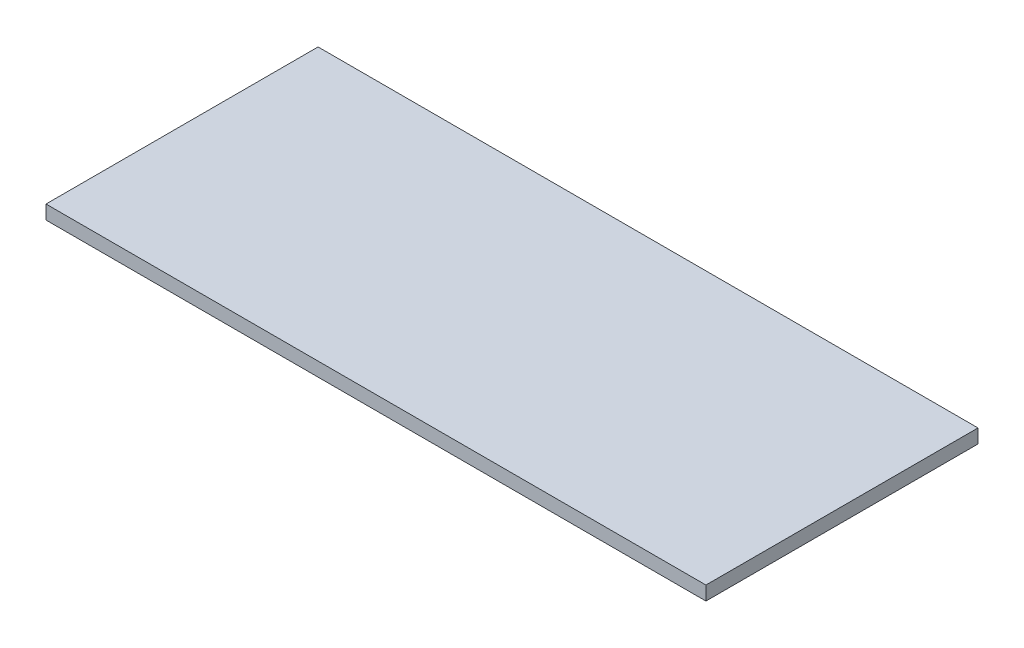
ISO-10303-21;
HEADER;
FILE_DESCRIPTION(('STEP AP214'),'2;1');
FILE_NAME('part.step','',(''),(''),'','','');
FILE_SCHEMA(('AUTOMOTIVE_DESIGN { 1 0 10303 214 1 1 1 1 }'));
ENDSEC;
DATA;
#1=APPLICATION_CONTEXT('core data for automotive mechanical design processes');
#2=APPLICATION_PROTOCOL_DEFINITION('international standard','automotive_design',2000,#1);
#3=PRODUCT_CONTEXT('',#1,'mechanical');
#4=PRODUCT('Part','Part','',(#3));
#5=PRODUCT_RELATED_PRODUCT_CATEGORY('part','',(#4));
#6=PRODUCT_DEFINITION_FORMATION('','',#4);
#7=PRODUCT_DEFINITION_CONTEXT('part definition',#1,'design');
#8=PRODUCT_DEFINITION('design','',#6,#7);
#9=PRODUCT_DEFINITION_SHAPE('','',#8);
#10=(LENGTH_UNIT() NAMED_UNIT(*) SI_UNIT(.MILLI.,.METRE.));
#11=(NAMED_UNIT(*) PLANE_ANGLE_UNIT() SI_UNIT($,.RADIAN.));
#12=(NAMED_UNIT(*) SI_UNIT($,.STERADIAN.) SOLID_ANGLE_UNIT());
#13=UNCERTAINTY_MEASURE_WITH_UNIT(LENGTH_MEASURE(1.E-05),#10,'distance_accuracy_value','');
#14=(GEOMETRIC_REPRESENTATION_CONTEXT(3) GLOBAL_UNCERTAINTY_ASSIGNED_CONTEXT((#13)) GLOBAL_UNIT_ASSIGNED_CONTEXT((#10,
#11,#12)) REPRESENTATION_CONTEXT('',''));
#15=CARTESIAN_POINT('',(0.,0.,0.));
#16=DIRECTION('',(0.,0.,1.));
#17=DIRECTION('',(1.,0.,0.));
#18=AXIS2_PLACEMENT_3D('',#15,#16,#17);
#19=CARTESIAN_POINT('',(-836.602835572622,14.2875,165.857235018283));
#20=DIRECTION('',(1.,0.,0.));
#21=DIRECTION('',(0.,0.,-1.));
#22=AXIS2_PLACEMENT_3D('',#19,#20,#21);
#23=PLANE('',#22);
#24=DIRECTION('',(0.,0.,1.));
#25=VECTOR('',#24,1.);
#26=CARTESIAN_POINT('',(-836.602835572622,0.,165.857235018283));
#27=LINE('',#26,#25);
#28=CARTESIAN_POINT('',(-836.602835572622,0.,165.857235018283));
#29=VERTEX_POINT('',#28);
#30=CARTESIAN_POINT('',(-836.602835572622,0.,445.257235018283));
#31=VERTEX_POINT('',#30);
#32=EDGE_CURVE('E98',#29,#31,#27,.T.);
#33=ORIENTED_EDGE('',*,*,#32,.T.);
#34=DIRECTION('',(0.,-1.,0.));
#35=VECTOR('',#34,1.);
#36=CARTESIAN_POINT('',(-836.602835572622,14.2875,445.257235018283));
#37=LINE('',#36,#35);
#38=CARTESIAN_POINT('',(-836.602835572622,14.2875,445.257235018283));
#39=VERTEX_POINT('',#38);
#40=EDGE_CURVE('E11',#39,#31,#37,.T.);
#41=ORIENTED_EDGE('',*,*,#40,.F.);
#42=DIRECTION('',(0.,0.,1.));
#43=VECTOR('',#42,1.);
#44=CARTESIAN_POINT('',(-836.602835572622,14.2875,165.857235018283));
#45=LINE('',#44,#43);
#46=CARTESIAN_POINT('',(-836.602835572622,14.2875,165.857235018283));
#47=VERTEX_POINT('',#46);
#48=EDGE_CURVE('E86',#47,#39,#45,.T.);
#49=ORIENTED_EDGE('',*,*,#48,.F.);
#50=DIRECTION('',(0.,-1.,0.));
#51=VECTOR('',#50,1.);
#52=CARTESIAN_POINT('',(-836.602835572622,14.2875,165.857235018283));
#53=LINE('',#52,#51);
#54=EDGE_CURVE('E94',#47,#29,#53,.T.);
#55=ORIENTED_EDGE('',*,*,#54,.T.);
#56=EDGE_LOOP('',(#33,#41,#49,#55));
#57=FACE_BOUND('',#56,.T.);
#58=ADVANCED_FACE('F35',(#57),#23,.F.);
#59=CARTESIAN_POINT('',(-836.602835572622,14.2875,445.257235018283));
#60=DIRECTION('',(0.,0.,-1.));
#61=DIRECTION('',(-1.,0.,0.));
#62=AXIS2_PLACEMENT_3D('',#59,#60,#61);
#63=PLANE('',#62);
#64=DIRECTION('',(1.,0.,0.));
#65=VECTOR('',#64,1.);
#66=CARTESIAN_POINT('',(-836.602835572622,0.,445.257235018283));
#67=LINE('',#66,#65);
#68=CARTESIAN_POINT('',(-158.906249896622,0.,445.257235018283));
#69=VERTEX_POINT('',#68);
#70=EDGE_CURVE('E90',#31,#69,#67,.T.);
#71=ORIENTED_EDGE('',*,*,#70,.T.);
#72=DIRECTION('',(0.,-1.,0.));
#73=VECTOR('',#72,1.);
#74=CARTESIAN_POINT('',(-158.906249896622,14.2875,445.257235018283));
#75=LINE('',#74,#73);
#76=CARTESIAN_POINT('',(-158.906249896622,14.2875,445.257235018283));
#77=VERTEX_POINT('',#76);
#78=EDGE_CURVE('E43',#77,#69,#75,.T.);
#79=ORIENTED_EDGE('',*,*,#78,.F.);
#80=DIRECTION('',(1.,0.,0.));
#81=VECTOR('',#80,1.);
#82=CARTESIAN_POINT('',(-836.602835572622,14.2875,445.257235018283));
#83=LINE('',#82,#81);
#84=EDGE_CURVE('E81',#39,#77,#83,.T.);
#85=ORIENTED_EDGE('',*,*,#84,.F.);
#86=ORIENTED_EDGE('',*,*,#40,.T.);
#87=EDGE_LOOP('',(#71,#79,#85,#86));
#88=FACE_BOUND('',#87,.T.);
#89=ADVANCED_FACE('F89',(#88),#63,.F.);
#90=CARTESIAN_POINT('',(-158.906249896622,14.2875,165.857235018283));
#91=DIRECTION('',(-1.,0.,0.));
#92=DIRECTION('',(0.,0.,1.));
#93=AXIS2_PLACEMENT_3D('',#90,#91,#92);
#94=PLANE('',#93);
#95=DIRECTION('',(0.,0.,-1.));
#96=VECTOR('',#95,1.);
#97=CARTESIAN_POINT('',(-158.906249896622,0.,165.857235018283));
#98=LINE('',#97,#96);
#99=CARTESIAN_POINT('',(-158.906249896622,0.,165.857235018283));
#100=VERTEX_POINT('',#99);
#101=EDGE_CURVE('E68',#69,#100,#98,.T.);
#102=ORIENTED_EDGE('',*,*,#101,.T.);
#103=DIRECTION('',(0.,-1.,0.));
#104=VECTOR('',#103,1.);
#105=CARTESIAN_POINT('',(-158.906249896622,14.2875,165.857235018283));
#106=LINE('',#105,#104);
#107=CARTESIAN_POINT('',(-158.906249896622,14.2875,165.857235018283));
#108=VERTEX_POINT('',#107);
#109=EDGE_CURVE('E91',#108,#100,#106,.T.);
#110=ORIENTED_EDGE('',*,*,#109,.F.);
#111=DIRECTION('',(0.,0.,-1.));
#112=VECTOR('',#111,1.);
#113=CARTESIAN_POINT('',(-158.906249896622,14.2875,165.857235018283));
#114=LINE('',#113,#112);
#115=EDGE_CURVE('E84',#77,#108,#114,.T.);
#116=ORIENTED_EDGE('',*,*,#115,.F.);
#117=ORIENTED_EDGE('',*,*,#78,.T.);
#118=EDGE_LOOP('',(#102,#110,#116,#117));
#119=FACE_BOUND('',#118,.T.);
#120=ADVANCED_FACE('F92',(#119),#94,.F.);
#121=CARTESIAN_POINT('',(-836.602835572622,14.2875,165.857235018283));
#122=DIRECTION('',(0.,0.,1.));
#123=DIRECTION('',(1.,0.,0.));
#124=AXIS2_PLACEMENT_3D('',#121,#122,#123);
#125=PLANE('',#124);
#126=DIRECTION('',(-1.,0.,0.));
#127=VECTOR('',#126,1.);
#128=CARTESIAN_POINT('',(-836.602835572622,0.,165.857235018283));
#129=LINE('',#128,#127);
#130=EDGE_CURVE('E74',#100,#29,#129,.T.);
#131=ORIENTED_EDGE('',*,*,#130,.T.);
#132=ORIENTED_EDGE('',*,*,#54,.F.);
#133=DIRECTION('',(-1.,0.,0.));
#134=VECTOR('',#133,1.);
#135=CARTESIAN_POINT('',(-836.602835572622,14.2875,165.857235018283));
#136=LINE('',#135,#134);
#137=EDGE_CURVE('E51',#108,#47,#136,.T.);
#138=ORIENTED_EDGE('',*,*,#137,.F.);
#139=ORIENTED_EDGE('',*,*,#109,.T.);
#140=EDGE_LOOP('',(#131,#132,#138,#139));
#141=FACE_BOUND('',#140,.T.);
#142=ADVANCED_FACE('F105',(#141),#125,.F.);
#143=CARTESIAN_POINT('',(0.,14.2875,0.));
#144=DIRECTION('',(0.,1.,0.));
#145=DIRECTION('',(0.,0.,1.));
#146=AXIS2_PLACEMENT_3D('',#143,#144,#145);
#147=PLANE('',#146);
#148=ORIENTED_EDGE('',*,*,#48,.T.);
#149=ORIENTED_EDGE('',*,*,#84,.T.);
#150=ORIENTED_EDGE('',*,*,#115,.T.);
#151=ORIENTED_EDGE('',*,*,#137,.T.);
#152=EDGE_LOOP('',(#148,#149,#150,#151));
#153=FACE_BOUND('',#152,.T.);
#154=ADVANCED_FACE('F82',(#153),#147,.T.);
#155=CARTESIAN_POINT('',(0.,0.,0.));
#156=DIRECTION('',(0.,1.,0.));
#157=DIRECTION('',(0.,0.,1.));
#158=AXIS2_PLACEMENT_3D('',#155,#156,#157);
#159=PLANE('',#158);
#160=ORIENTED_EDGE('',*,*,#32,.F.);
#161=ORIENTED_EDGE('',*,*,#130,.F.);
#162=ORIENTED_EDGE('',*,*,#101,.F.);
#163=ORIENTED_EDGE('',*,*,#70,.F.);
#164=EDGE_LOOP('',(#160,#161,#162,#163));
#165=FACE_BOUND('',#164,.T.);
#166=ADVANCED_FACE('F108',(#165),#159,.F.);
#167=CLOSED_SHELL('',(#58,#89,#120,#142,#154,#166));
#168=MANIFOLD_SOLID_BREP('B2',#167);
#169=ADVANCED_BREP_SHAPE_REPRESENTATION('',(#18,#168),#14);
#170=SHAPE_DEFINITION_REPRESENTATION(#9,#169);
ENDSEC;
END-ISO-10303-21;
